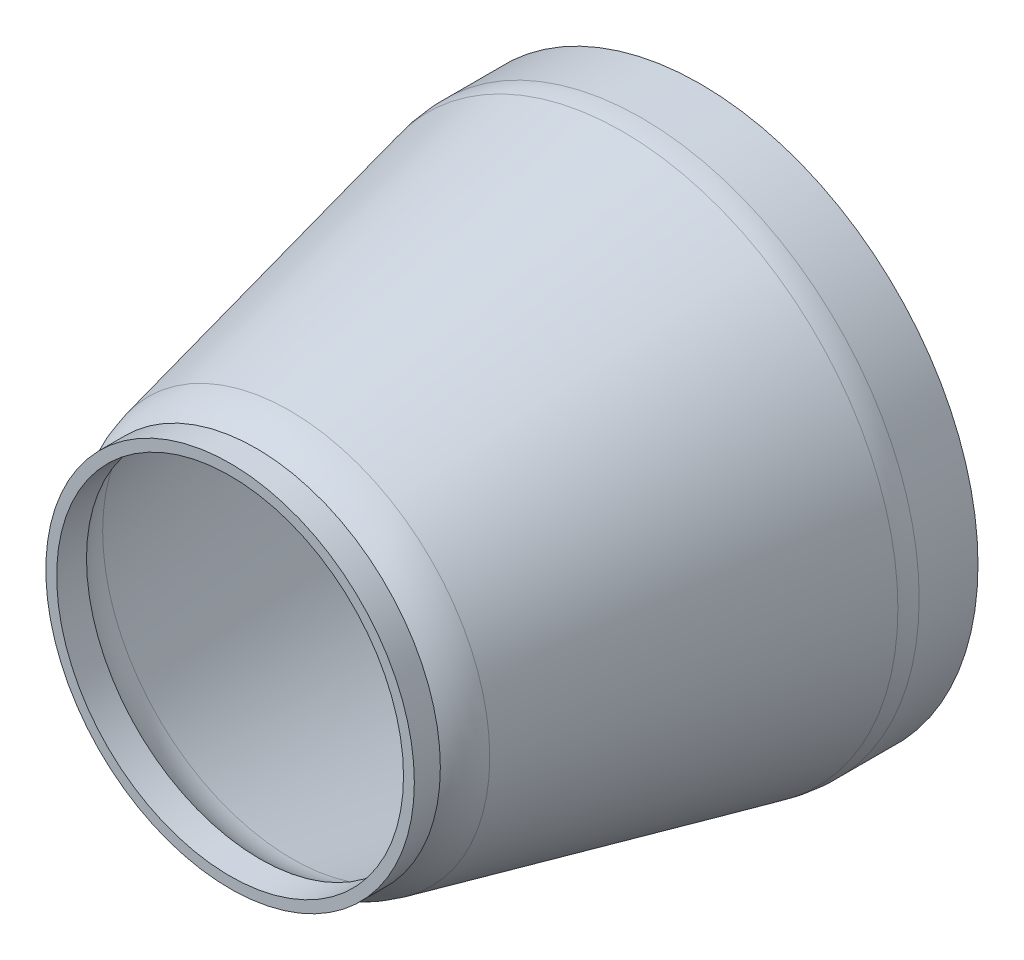
ISO-10303-21;
HEADER;
FILE_DESCRIPTION(('STEP AP214'),'2;1');
FILE_NAME('part.step','',(''),(''),'','','');
FILE_SCHEMA(('AUTOMOTIVE_DESIGN { 1 0 10303 214 1 1 1 1 }'));
ENDSEC;
DATA;
#1=APPLICATION_CONTEXT('core data for automotive mechanical design processes');
#2=APPLICATION_PROTOCOL_DEFINITION('international standard','automotive_design',2000,#1);
#3=PRODUCT_CONTEXT('',#1,'mechanical');
#4=PRODUCT('Part','Part','',(#3));
#5=PRODUCT_RELATED_PRODUCT_CATEGORY('part','',(#4));
#6=PRODUCT_DEFINITION_FORMATION('','',#4);
#7=PRODUCT_DEFINITION_CONTEXT('part definition',#1,'design');
#8=PRODUCT_DEFINITION('design','',#6,#7);
#9=PRODUCT_DEFINITION_SHAPE('','',#8);
#10=(LENGTH_UNIT() NAMED_UNIT(*) SI_UNIT(.MILLI.,.METRE.));
#11=(NAMED_UNIT(*) PLANE_ANGLE_UNIT() SI_UNIT($,.RADIAN.));
#12=(NAMED_UNIT(*) SI_UNIT($,.STERADIAN.) SOLID_ANGLE_UNIT());
#13=UNCERTAINTY_MEASURE_WITH_UNIT(LENGTH_MEASURE(1.E-05),#10,'distance_accuracy_value','');
#14=(GEOMETRIC_REPRESENTATION_CONTEXT(3) GLOBAL_UNCERTAINTY_ASSIGNED_CONTEXT((#13)) GLOBAL_UNIT_ASSIGNED_CONTEXT((#10,
#11,#12)) REPRESENTATION_CONTEXT('',''));
#15=CARTESIAN_POINT('',(0.,0.,0.));
#16=DIRECTION('',(0.,0.,1.));
#17=DIRECTION('',(1.,0.,0.));
#18=AXIS2_PLACEMENT_3D('',#15,#16,#17);
#19=CARTESIAN_POINT('',(0.,0.,6.));
#20=DIRECTION('',(0.,0.,-1.));
#21=DIRECTION('',(-1.,0.,0.));
#22=AXIS2_PLACEMENT_3D('',#19,#20,#21);
#23=PLANE('',#22);
#24=CARTESIAN_POINT('',(0.,0.,6.00000000000001));
#25=DIRECTION('',(0.,0.,1.));
#26=DIRECTION('',(1.,0.,0.));
#27=AXIS2_PLACEMENT_3D('',#24,#25,#26);
#28=CIRCLE('',#27,47.8161785944028);
#29=CARTESIAN_POINT('',(47.8161785944028,0.,6.00000000000001));
#30=VERTEX_POINT('',#29);
#31=EDGE_CURVE('E45',#30,#30,#28,.T.);
#32=ORIENTED_EDGE('',*,*,#31,.F.);
#33=EDGE_LOOP('',(#32));
#34=FACE_BOUND('',#33,.T.);
#35=ADVANCED_FACE('F34',(#34),#23,.T.);
#36=CARTESIAN_POINT('',(0.,0.,0.));
#37=DIRECTION('',(0.,0.,-1.));
#38=DIRECTION('',(-1.,0.,0.));
#39=AXIS2_PLACEMENT_3D('',#36,#37,#38);
#40=CONICAL_SURFACE('',#39,50.,0.349065850398862);
#41=ORIENTED_EDGE('',*,*,#31,.T.);
#42=EDGE_LOOP('',(#41));
#43=FACE_BOUND('',#42,.T.);
#44=CARTESIAN_POINT('',(0.,0.,0.));
#45=DIRECTION('',(0.,0.,1.));
#46=DIRECTION('',(1.,0.,0.));
#47=AXIS2_PLACEMENT_3D('',#44,#45,#46);
#48=CIRCLE('',#47,50.);
#49=CARTESIAN_POINT('',(50.,0.,0.));
#50=VERTEX_POINT('',#49);
#51=EDGE_CURVE('E49',#50,#50,#48,.T.);
#52=ORIENTED_EDGE('',*,*,#51,.F.);
#53=EDGE_LOOP('',(#52));
#54=FACE_BOUND('',#53,.T.);
#55=ADVANCED_FACE('F118',(#43,#54),#40,.F.);
#56=CARTESIAN_POINT('',(50.,0.,0.));
#57=DIRECTION('',(0.,0.,-1.));
#58=DIRECTION('',(-1.,0.,0.));
#59=AXIS2_PLACEMENT_3D('',#56,#57,#58);
#60=PLANE('',#59);
#61=ORIENTED_EDGE('',*,*,#51,.T.);
#62=EDGE_LOOP('',(#61));
#63=FACE_BOUND('',#62,.T.);
#64=CARTESIAN_POINT('',(0.,0.,0.));
#65=DIRECTION('',(0.,0.,1.));
#66=DIRECTION('',(1.,0.,0.));
#67=AXIS2_PLACEMENT_3D('',#64,#65,#66);
#68=CIRCLE('',#67,64.);
#69=CARTESIAN_POINT('',(64.,0.,0.));
#70=VERTEX_POINT('',#69);
#71=EDGE_CURVE('E54',#70,#70,#68,.T.);
#72=ORIENTED_EDGE('',*,*,#71,.F.);
#73=EDGE_LOOP('',(#72));
#74=FACE_BOUND('',#73,.T.);
#75=ADVANCED_FACE('F123',(#63,#74),#60,.T.);
#76=CARTESIAN_POINT('',(0.,0.,108.5));
#77=DIRECTION('',(0.,0.,1.));
#78=DIRECTION('',(1.,0.,0.));
#79=AXIS2_PLACEMENT_3D('',#76,#77,#78);
#80=CYLINDRICAL_SURFACE('',#79,64.);
#81=CARTESIAN_POINT('',(0.,0.,13.5654765684899));
#82=DIRECTION('',(0.,0.,-1.));
#83=DIRECTION('',(-1.,0.,0.));
#84=AXIS2_PLACEMENT_3D('',#81,#82,#83);
#85=CIRCLE('',#84,64.);
#86=CARTESIAN_POINT('',(-64.,0.,13.5654765684899));
#87=VERTEX_POINT('',#86);
#88=EDGE_CURVE('E10',#87,#87,#85,.T.);
#89=ORIENTED_EDGE('',*,*,#88,.T.);
#90=EDGE_LOOP('',(#89));
#91=FACE_BOUND('',#90,.T.);
#92=ORIENTED_EDGE('',*,*,#71,.T.);
#93=EDGE_LOOP('',(#92));
#94=FACE_BOUND('',#93,.T.);
#95=ADVANCED_FACE('F130',(#91,#94),#80,.T.);
#96=CARTESIAN_POINT('',(0.,0.,94.742026454793));
#97=DIRECTION('',(0.,0.,-1.));
#98=DIRECTION('',(-1.,0.,0.));
#99=AXIS2_PLACEMENT_3D('',#96,#97,#98);
#100=CONICAL_SURFACE('',#99,46.1372431118464,0.222529479629263);
#101=CARTESIAN_POINT('',(0.,0.,17.9794252689196));
#102=DIRECTION('',(0.,0.,1.));
#103=DIRECTION('',(1.,0.,0.));
#104=AXIS2_PLACEMENT_3D('',#101,#102,#103);
#105=CIRCLE('',#104,63.5068464101703);
#106=CARTESIAN_POINT('',(63.5068464101703,0.,17.9794252689196));
#107=VERTEX_POINT('',#106);
#108=EDGE_CURVE('E41',#107,#107,#105,.T.);
#109=ORIENTED_EDGE('',*,*,#108,.T.);
#110=EDGE_LOOP('',(#109));
#111=FACE_BOUND('',#110,.T.);
#112=CARTESIAN_POINT('',(0.,0.,94.742026454793));
#113=DIRECTION('',(0.,0.,1.));
#114=DIRECTION('',(1.,0.,0.));
#115=AXIS2_PLACEMENT_3D('',#112,#113,#114);
#116=CIRCLE('',#115,46.1372431118464);
#117=CARTESIAN_POINT('',(46.1372431118464,0.,94.742026454793));
#118=VERTEX_POINT('',#117);
#119=EDGE_CURVE('E57',#118,#118,#116,.T.);
#120=ORIENTED_EDGE('',*,*,#119,.F.);
#121=EDGE_LOOP('',(#120));
#122=FACE_BOUND('',#121,.T.);
#123=ADVANCED_FACE('F134',(#111,#122),#100,.T.);
#124=CARTESIAN_POINT('',(0.,0.,90.3280777543633));
#125=DIRECTION('',(0.,0.,1.));
#126=DIRECTION('',(1.,0.,0.));
#127=AXIS2_PLACEMENT_3D('',#124,#125,#126);
#128=TOROIDAL_SURFACE('',#127,26.630396701676,20.);
#129=ORIENTED_EDGE('',*,*,#119,.T.);
#130=EDGE_LOOP('',(#129));
#131=FACE_BOUND('',#130,.T.);
#132=CARTESIAN_POINT('',(0.,0.,102.5));
#133=DIRECTION('',(0.,0.,1.));
#134=DIRECTION('',(1.,0.,0.));
#135=AXIS2_PLACEMENT_3D('',#132,#133,#134);
#136=CIRCLE('',#135,42.5);
#137=CARTESIAN_POINT('',(42.5,0.,102.5));
#138=VERTEX_POINT('',#137);
#139=EDGE_CURVE('E60',#138,#138,#136,.T.);
#140=ORIENTED_EDGE('',*,*,#139,.F.);
#141=EDGE_LOOP('',(#140));
#142=FACE_BOUND('',#141,.T.);
#143=ADVANCED_FACE('F137',(#131,#142),#128,.T.);
#144=CARTESIAN_POINT('',(0.,0.,108.5));
#145=DIRECTION('',(0.,0.,1.));
#146=DIRECTION('',(1.,0.,0.));
#147=AXIS2_PLACEMENT_3D('',#144,#145,#146);
#148=CYLINDRICAL_SURFACE('',#147,42.5);
#149=ORIENTED_EDGE('',*,*,#139,.T.);
#150=EDGE_LOOP('',(#149));
#151=FACE_BOUND('',#150,.T.);
#152=CARTESIAN_POINT('',(0.,0.,108.5));
#153=DIRECTION('',(0.,0.,1.));
#154=DIRECTION('',(1.,0.,0.));
#155=AXIS2_PLACEMENT_3D('',#152,#153,#154);
#156=CIRCLE('',#155,42.5);
#157=CARTESIAN_POINT('',(42.5,0.,108.5));
#158=VERTEX_POINT('',#157);
#159=EDGE_CURVE('E63',#158,#158,#156,.T.);
#160=ORIENTED_EDGE('',*,*,#159,.F.);
#161=EDGE_LOOP('',(#160));
#162=FACE_BOUND('',#161,.T.);
#163=ADVANCED_FACE('F140',(#151,#162),#148,.T.);
#164=CARTESIAN_POINT('',(42.5,0.,108.5));
#165=DIRECTION('',(0.,0.,1.));
#166=DIRECTION('',(1.,0.,0.));
#167=AXIS2_PLACEMENT_3D('',#164,#165,#166);
#168=PLANE('',#167);
#169=CARTESIAN_POINT('',(0.,0.,108.5));
#170=DIRECTION('',(0.,0.,1.));
#171=DIRECTION('',(1.,0.,0.));
#172=AXIS2_PLACEMENT_3D('',#169,#170,#171);
#173=CIRCLE('',#172,40.);
#174=CARTESIAN_POINT('',(40.,0.,108.5));
#175=VERTEX_POINT('',#174);
#176=EDGE_CURVE('E67',#175,#175,#173,.T.);
#177=ORIENTED_EDGE('',*,*,#176,.F.);
#178=EDGE_LOOP('',(#177));
#179=FACE_BOUND('',#178,.T.);
#180=ORIENTED_EDGE('',*,*,#159,.T.);
#181=EDGE_LOOP('',(#180));
#182=FACE_BOUND('',#181,.T.);
#183=ADVANCED_FACE('F144',(#179,#182),#168,.T.);
#184=CARTESIAN_POINT('',(0.,0.,13.5654765684899));
#185=DIRECTION('',(0.,0.,-1.));
#186=DIRECTION('',(-1.,0.,0.));
#187=AXIS2_PLACEMENT_3D('',#184,#185,#186);
#188=TOROIDAL_SURFACE('',#187,44.,20.);
#189=ORIENTED_EDGE('',*,*,#88,.F.);
#190=EDGE_LOOP('',(#189));
#191=FACE_BOUND('',#190,.T.);
#192=ORIENTED_EDGE('',*,*,#108,.F.);
#193=EDGE_LOOP('',(#192));
#194=FACE_BOUND('',#193,.T.);
#195=ADVANCED_FACE('F36',(#191,#194),#188,.T.);
#196=CARTESIAN_POINT('',(0.,0.,8.5));
#197=DIRECTION('',(0.,0.,-1.));
#198=DIRECTION('',(-1.,0.,0.));
#199=AXIS2_PLACEMENT_3D('',#196,#197,#198);
#200=PLANE('',#199);
#201=CARTESIAN_POINT('',(0.,0.,8.5));
#202=DIRECTION('',(0.,0.,-1.));
#203=DIRECTION('',(-1.,0.,0.));
#204=AXIS2_PLACEMENT_3D('',#201,#202,#203);
#205=CIRCLE('',#204,49.5666974399271);
#206=CARTESIAN_POINT('',(-49.5666974399271,0.,8.5));
#207=VERTEX_POINT('',#206);
#208=EDGE_CURVE('E80',#207,#207,#205,.F.);
#209=ORIENTED_EDGE('',*,*,#208,.T.);
#210=EDGE_LOOP('',(#209));
#211=FACE_BOUND('',#210,.T.);
#212=ADVANCED_FACE('F91',(#211),#200,.F.);
#213=CARTESIAN_POINT('',(0.,0.,0.855050358314163));
#214=DIRECTION('',(0.,0.,-1.));
#215=DIRECTION('',(-1.,0.,0.));
#216=AXIS2_PLACEMENT_3D('',#213,#214,#215);
#217=CONICAL_SURFACE('',#216,52.3492315519648,0.349065850398862);
#218=ORIENTED_EDGE('',*,*,#208,.F.);
#219=EDGE_LOOP('',(#218));
#220=FACE_BOUND('',#219,.T.);
#221=CARTESIAN_POINT('',(0.,0.,2.5));
#222=DIRECTION('',(0.,0.,-1.));
#223=DIRECTION('',(-1.,0.,0.));
#224=AXIS2_PLACEMENT_3D('',#221,#222,#223);
#225=CIRCLE('',#224,51.7505188455243);
#226=CARTESIAN_POINT('',(-51.7505188455243,0.,2.5));
#227=VERTEX_POINT('',#226);
#228=EDGE_CURVE('E85',#227,#227,#225,.F.);
#229=ORIENTED_EDGE('',*,*,#228,.T.);
#230=EDGE_LOOP('',(#229));
#231=FACE_BOUND('',#230,.T.);
#232=ADVANCED_FACE('F93',(#220,#231),#217,.T.);
#233=CARTESIAN_POINT('',(50.,0.,2.5));
#234=DIRECTION('',(0.,0.,-1.));
#235=DIRECTION('',(-1.,0.,0.));
#236=AXIS2_PLACEMENT_3D('',#233,#234,#235);
#237=PLANE('',#236);
#238=ORIENTED_EDGE('',*,*,#228,.F.);
#239=EDGE_LOOP('',(#238));
#240=FACE_BOUND('',#239,.T.);
#241=CARTESIAN_POINT('',(0.,0.,2.5));
#242=DIRECTION('',(0.,0.,-1.));
#243=DIRECTION('',(-1.,0.,0.));
#244=AXIS2_PLACEMENT_3D('',#241,#242,#243);
#245=CIRCLE('',#244,61.5);
#246=CARTESIAN_POINT('',(-61.5,0.,2.5));
#247=VERTEX_POINT('',#246);
#248=EDGE_CURVE('E76',#247,#247,#245,.F.);
#249=ORIENTED_EDGE('',*,*,#248,.T.);
#250=EDGE_LOOP('',(#249));
#251=FACE_BOUND('',#250,.T.);
#252=ADVANCED_FACE('F96',(#240,#251),#237,.F.);
#253=CARTESIAN_POINT('',(0.,0.,108.5));
#254=DIRECTION('',(0.,0.,1.));
#255=DIRECTION('',(1.,0.,0.));
#256=AXIS2_PLACEMENT_3D('',#253,#254,#255);
#257=CYLINDRICAL_SURFACE('',#256,61.5);
#258=CARTESIAN_POINT('',(0.,0.,13.5654765684899));
#259=DIRECTION('',(0.,0.,1.));
#260=DIRECTION('',(1.,0.,0.));
#261=AXIS2_PLACEMENT_3D('',#258,#259,#260);
#262=CIRCLE('',#261,61.5);
#263=CARTESIAN_POINT('',(61.5,0.,13.5654765684899));
#264=VERTEX_POINT('',#263);
#265=EDGE_CURVE('E66',#264,#264,#262,.F.);
#266=ORIENTED_EDGE('',*,*,#265,.F.);
#267=EDGE_LOOP('',(#266));
#268=FACE_BOUND('',#267,.T.);
#269=ORIENTED_EDGE('',*,*,#248,.F.);
#270=EDGE_LOOP('',(#269));
#271=FACE_BOUND('',#270,.T.);
#272=ADVANCED_FACE('F102',(#268,#271),#257,.F.);
#273=CARTESIAN_POINT('',(0.,0.,94.1902828672393));
#274=DIRECTION('',(0.,0.,-1.));
#275=DIRECTION('',(-1.,0.,0.));
#276=AXIS2_PLACEMENT_3D('',#273,#274,#275);
#277=CONICAL_SURFACE('',#276,43.6988873105751,0.222529479629263);
#278=CARTESIAN_POINT('',(0.,0.,17.4276816813659));
#279=DIRECTION('',(0.,0.,-1.));
#280=DIRECTION('',(-1.,0.,0.));
#281=AXIS2_PLACEMENT_3D('',#278,#279,#280);
#282=CIRCLE('',#281,61.068490608899);
#283=CARTESIAN_POINT('',(-61.068490608899,0.,17.4276816813659));
#284=VERTEX_POINT('',#283);
#285=EDGE_CURVE('E77',#284,#284,#282,.F.);
#286=ORIENTED_EDGE('',*,*,#285,.F.);
#287=EDGE_LOOP('',(#286));
#288=FACE_BOUND('',#287,.T.);
#289=CARTESIAN_POINT('',(0.,0.,94.1902828672393));
#290=DIRECTION('',(0.,0.,1.));
#291=DIRECTION('',(1.,0.,0.));
#292=AXIS2_PLACEMENT_3D('',#289,#290,#291);
#293=CIRCLE('',#292,43.6988873105751);
#294=CARTESIAN_POINT('',(43.6988873105751,0.,94.1902828672393));
#295=VERTEX_POINT('',#294);
#296=EDGE_CURVE('E73',#295,#295,#293,.T.);
#297=ORIENTED_EDGE('',*,*,#296,.T.);
#298=EDGE_LOOP('',(#297));
#299=FACE_BOUND('',#298,.T.);
#300=ADVANCED_FACE('F107',(#288,#299),#277,.F.);
#301=CARTESIAN_POINT('',(0.,0.,90.3280777543633));
#302=DIRECTION('',(0.,0.,1.));
#303=DIRECTION('',(1.,0.,0.));
#304=AXIS2_PLACEMENT_3D('',#301,#302,#303);
#305=TOROIDAL_SURFACE('',#304,26.630396701676,17.5);
#306=ORIENTED_EDGE('',*,*,#296,.F.);
#307=EDGE_LOOP('',(#306));
#308=FACE_BOUND('',#307,.T.);
#309=CARTESIAN_POINT('',(0.,0.,101.619831721106));
#310=DIRECTION('',(0.,0.,-1.));
#311=DIRECTION('',(-1.,0.,0.));
#312=AXIS2_PLACEMENT_3D('',#309,#310,#311);
#313=CIRCLE('',#312,40.);
#314=CARTESIAN_POINT('',(-40.,0.,101.619831721106));
#315=VERTEX_POINT('',#314);
#316=EDGE_CURVE('E70',#315,#315,#313,.F.);
#317=ORIENTED_EDGE('',*,*,#316,.T.);
#318=EDGE_LOOP('',(#317));
#319=FACE_BOUND('',#318,.T.);
#320=ADVANCED_FACE('F113',(#308,#319),#305,.F.);
#321=CARTESIAN_POINT('',(0.,0.,108.5));
#322=DIRECTION('',(0.,0.,1.));
#323=DIRECTION('',(1.,0.,0.));
#324=AXIS2_PLACEMENT_3D('',#321,#322,#323);
#325=CYLINDRICAL_SURFACE('',#324,40.);
#326=ORIENTED_EDGE('',*,*,#316,.F.);
#327=EDGE_LOOP('',(#326));
#328=FACE_BOUND('',#327,.T.);
#329=ORIENTED_EDGE('',*,*,#176,.T.);
#330=EDGE_LOOP('',(#329));
#331=FACE_BOUND('',#330,.T.);
#332=ADVANCED_FACE('F152',(#328,#331),#325,.F.);
#333=CARTESIAN_POINT('',(0.,0.,13.5654765684899));
#334=DIRECTION('',(0.,0.,-1.));
#335=DIRECTION('',(-1.,0.,0.));
#336=AXIS2_PLACEMENT_3D('',#333,#334,#335);
#337=TOROIDAL_SURFACE('',#336,44.,17.5);
#338=ORIENTED_EDGE('',*,*,#265,.T.);
#339=EDGE_LOOP('',(#338));
#340=FACE_BOUND('',#339,.T.);
#341=ORIENTED_EDGE('',*,*,#285,.T.);
#342=EDGE_LOOP('',(#341));
#343=FACE_BOUND('',#342,.T.);
#344=ADVANCED_FACE('F149',(#340,#343),#337,.F.);
#345=CLOSED_SHELL('',(#35,#55,#75,#95,#123,#143,#163,#183,#195,#212,#232,#252,#272,#300,#320,
#332,#344));
#346=MANIFOLD_SOLID_BREP('B2',#345);
#347=ADVANCED_BREP_SHAPE_REPRESENTATION('',(#18,#346),#14);
#348=SHAPE_DEFINITION_REPRESENTATION(#9,#347);
ENDSEC;
END-ISO-10303-21;
